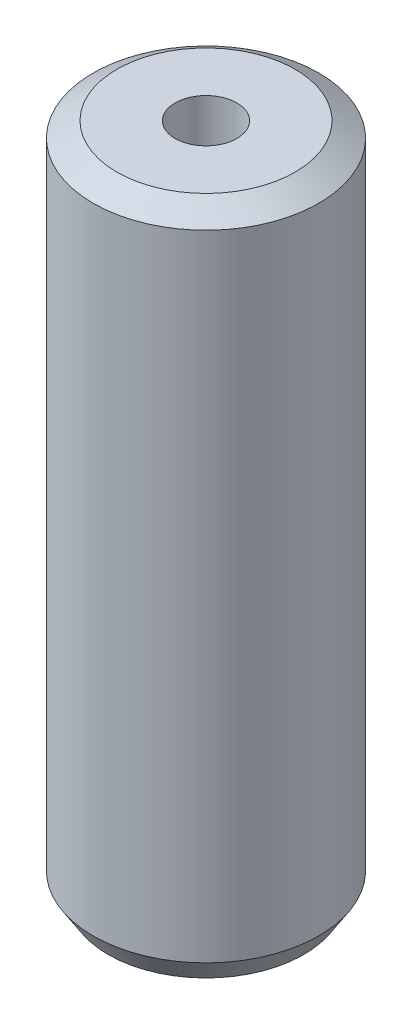
ISO-10303-21;
HEADER;
FILE_DESCRIPTION(('STEP AP214'),'2;1');
FILE_NAME('part.step','',(''),(''),'','','');
FILE_SCHEMA(('AUTOMOTIVE_DESIGN { 1 0 10303 214 1 1 1 1 }'));
ENDSEC;
DATA;
#1=APPLICATION_CONTEXT('core data for automotive mechanical design processes');
#2=APPLICATION_PROTOCOL_DEFINITION('international standard','automotive_design',2000,#1);
#3=PRODUCT_CONTEXT('',#1,'mechanical');
#4=PRODUCT('Part','Part','',(#3));
#5=PRODUCT_RELATED_PRODUCT_CATEGORY('part','',(#4));
#6=PRODUCT_DEFINITION_FORMATION('','',#4);
#7=PRODUCT_DEFINITION_CONTEXT('part definition',#1,'design');
#8=PRODUCT_DEFINITION('design','',#6,#7);
#9=PRODUCT_DEFINITION_SHAPE('','',#8);
#10=(LENGTH_UNIT() NAMED_UNIT(*) SI_UNIT(.MILLI.,.METRE.));
#11=(NAMED_UNIT(*) PLANE_ANGLE_UNIT() SI_UNIT($,.RADIAN.));
#12=(NAMED_UNIT(*) SI_UNIT($,.STERADIAN.) SOLID_ANGLE_UNIT());
#13=UNCERTAINTY_MEASURE_WITH_UNIT(LENGTH_MEASURE(1.E-05),#10,'distance_accuracy_value','');
#14=(GEOMETRIC_REPRESENTATION_CONTEXT(3) GLOBAL_UNCERTAINTY_ASSIGNED_CONTEXT((#13)) GLOBAL_UNIT_ASSIGNED_CONTEXT((#10,
#11,#12)) REPRESENTATION_CONTEXT('',''));
#15=CARTESIAN_POINT('',(0.,0.,0.));
#16=DIRECTION('',(0.,0.,1.));
#17=DIRECTION('',(1.,0.,0.));
#18=AXIS2_PLACEMENT_3D('',#15,#16,#17);
#19=CARTESIAN_POINT('',(0.,89.4946894687509,0.));
#20=DIRECTION('',(0.,-1.,0.));
#21=DIRECTION('',(0.,0.,-1.));
#22=AXIS2_PLACEMENT_3D('',#19,#20,#21);
#23=CYLINDRICAL_SURFACE('',#22,15.);
#24=CARTESIAN_POINT('',(0.,87.4905497164359,0.));
#25=DIRECTION('',(0.,1.,0.));
#26=DIRECTION('',(0.,0.,1.));
#27=AXIS2_PLACEMENT_3D('',#24,#25,#26);
#28=CIRCLE('',#27,15.);
#29=CARTESIAN_POINT('',(0.,87.4905497164359,15.));
#30=VERTEX_POINT('',#29);
#31=EDGE_CURVE('E50',#30,#30,#28,.F.);
#32=ORIENTED_EDGE('',*,*,#31,.T.);
#33=EDGE_LOOP('',(#32));
#34=FACE_BOUND('',#33,.T.);
#35=CARTESIAN_POINT('',(0.,3.15460871946444,0.));
#36=DIRECTION('',(0.,1.,0.));
#37=DIRECTION('',(0.,0.,1.));
#38=AXIS2_PLACEMENT_3D('',#35,#36,#37);
#39=CIRCLE('',#38,15.);
#40=CARTESIAN_POINT('',(0.,3.15460871946444,15.));
#41=VERTEX_POINT('',#40);
#42=EDGE_CURVE('E51',#41,#41,#39,.T.);
#43=ORIENTED_EDGE('',*,*,#42,.T.);
#44=EDGE_LOOP('',(#43));
#45=FACE_BOUND('',#44,.T.);
#46=ADVANCED_FACE('F39',(#34,#45),#23,.T.);
#47=CARTESIAN_POINT('',(0.,89.4946894687509,0.));
#48=DIRECTION('',(0.,1.,0.));
#49=DIRECTION('',(0.,0.,1.));
#50=AXIS2_PLACEMENT_3D('',#47,#48,#49);
#51=PLANE('',#50);
#52=CARTESIAN_POINT('',(0.,89.4946894687509,0.));
#53=DIRECTION('',(0.,1.,0.));
#54=DIRECTION('',(0.,0.,1.));
#55=AXIS2_PLACEMENT_3D('',#52,#53,#54);
#56=CIRCLE('',#55,11.8453912805355);
#57=CARTESIAN_POINT('',(0.,89.4946894687509,11.8453912805355));
#58=VERTEX_POINT('',#57);
#59=EDGE_CURVE('E54',#58,#58,#56,.T.);
#60=ORIENTED_EDGE('',*,*,#59,.T.);
#61=EDGE_LOOP('',(#60));
#62=FACE_BOUND('',#61,.T.);
#63=CARTESIAN_POINT('',(0.,89.4946894687509,0.));
#64=DIRECTION('',(0.,1.,0.));
#65=DIRECTION('',(0.,0.,1.));
#66=AXIS2_PLACEMENT_3D('',#63,#64,#65);
#67=CIRCLE('',#66,4.10030733268627);
#68=CARTESIAN_POINT('',(0.,89.4946894687509,4.10030733268627));
#69=VERTEX_POINT('',#68);
#70=EDGE_CURVE('E58',#69,#69,#67,.T.);
#71=ORIENTED_EDGE('',*,*,#70,.F.);
#72=EDGE_LOOP('',(#71));
#73=FACE_BOUND('',#72,.T.);
#74=ADVANCED_FACE('F69',(#62,#73),#51,.T.);
#75=CARTESIAN_POINT('',(0.,0.,0.));
#76=DIRECTION('',(0.,1.,0.));
#77=DIRECTION('',(0.,0.,1.));
#78=AXIS2_PLACEMENT_3D('',#75,#76,#77);
#79=PLANE('',#78);
#80=CARTESIAN_POINT('',(0.,0.,0.));
#81=DIRECTION('',(0.,1.,0.));
#82=DIRECTION('',(0.,0.,1.));
#83=AXIS2_PLACEMENT_3D('',#80,#81,#82);
#84=CIRCLE('',#83,12.9958602476851);
#85=CARTESIAN_POINT('',(0.,0.,12.9958602476851));
#86=VERTEX_POINT('',#85);
#87=EDGE_CURVE('E10',#86,#86,#84,.F.);
#88=ORIENTED_EDGE('',*,*,#87,.T.);
#89=EDGE_LOOP('',(#88));
#90=FACE_BOUND('',#89,.T.);
#91=CARTESIAN_POINT('',(0.,0.,0.));
#92=DIRECTION('',(0.,1.,0.));
#93=DIRECTION('',(0.,0.,1.));
#94=AXIS2_PLACEMENT_3D('',#91,#92,#93);
#95=CIRCLE('',#94,4.10030733268627);
#96=CARTESIAN_POINT('',(0.,0.,4.10030733268627));
#97=VERTEX_POINT('',#96);
#98=EDGE_CURVE('E63',#97,#97,#95,.T.);
#99=ORIENTED_EDGE('',*,*,#98,.T.);
#100=EDGE_LOOP('',(#99));
#101=FACE_BOUND('',#100,.T.);
#102=ADVANCED_FACE('F75',(#90,#101),#79,.F.);
#103=CARTESIAN_POINT('',(0.,89.4946894687509,0.));
#104=DIRECTION('',(0.,-1.,0.));
#105=DIRECTION('',(0.,0.,-1.));
#106=AXIS2_PLACEMENT_3D('',#103,#104,#105);
#107=CYLINDRICAL_SURFACE('',#106,4.10030733268627);
#108=ORIENTED_EDGE('',*,*,#70,.T.);
#109=EDGE_LOOP('',(#108));
#110=FACE_BOUND('',#109,.T.);
#111=ORIENTED_EDGE('',*,*,#98,.F.);
#112=EDGE_LOOP('',(#111));
#113=FACE_BOUND('',#112,.T.);
#114=ADVANCED_FACE('F70',(#110,#113),#107,.F.);
#115=CARTESIAN_POINT('',(0.,89.4946894687509,0.));
#116=DIRECTION('',(0.,-1.,0.));
#117=DIRECTION('',(0.,0.,-1.));
#118=AXIS2_PLACEMENT_3D('',#115,#116,#117);
#119=CONICAL_SURFACE('',#118,11.8453912805355,1.00482073125743);
#120=ORIENTED_EDGE('',*,*,#31,.F.);
#121=EDGE_LOOP('',(#120));
#122=FACE_BOUND('',#121,.T.);
#123=ORIENTED_EDGE('',*,*,#59,.F.);
#124=EDGE_LOOP('',(#123));
#125=FACE_BOUND('',#124,.T.);
#126=ADVANCED_FACE('F81',(#122,#125),#119,.T.);
#127=CARTESIAN_POINT('',(0.,3.15460871946444,0.));
#128=DIRECTION('',(0.,1.,0.));
#129=DIRECTION('',(0.,0.,1.));
#130=AXIS2_PLACEMENT_3D('',#127,#128,#129);
#131=CONICAL_SURFACE('',#130,15.,0.565975595537469);
#132=ORIENTED_EDGE('',*,*,#87,.F.);
#133=EDGE_LOOP('',(#132));
#134=FACE_BOUND('',#133,.T.);
#135=ORIENTED_EDGE('',*,*,#42,.F.);
#136=EDGE_LOOP('',(#135));
#137=FACE_BOUND('',#136,.T.);
#138=ADVANCED_FACE('F45',(#134,#137),#131,.T.);
#139=CLOSED_SHELL('',(#46,#74,#102,#114,#126,#138));
#140=MANIFOLD_SOLID_BREP('B2',#139);
#141=ADVANCED_BREP_SHAPE_REPRESENTATION('',(#18,#140),#14);
#142=SHAPE_DEFINITION_REPRESENTATION(#9,#141);
ENDSEC;
END-ISO-10303-21;
